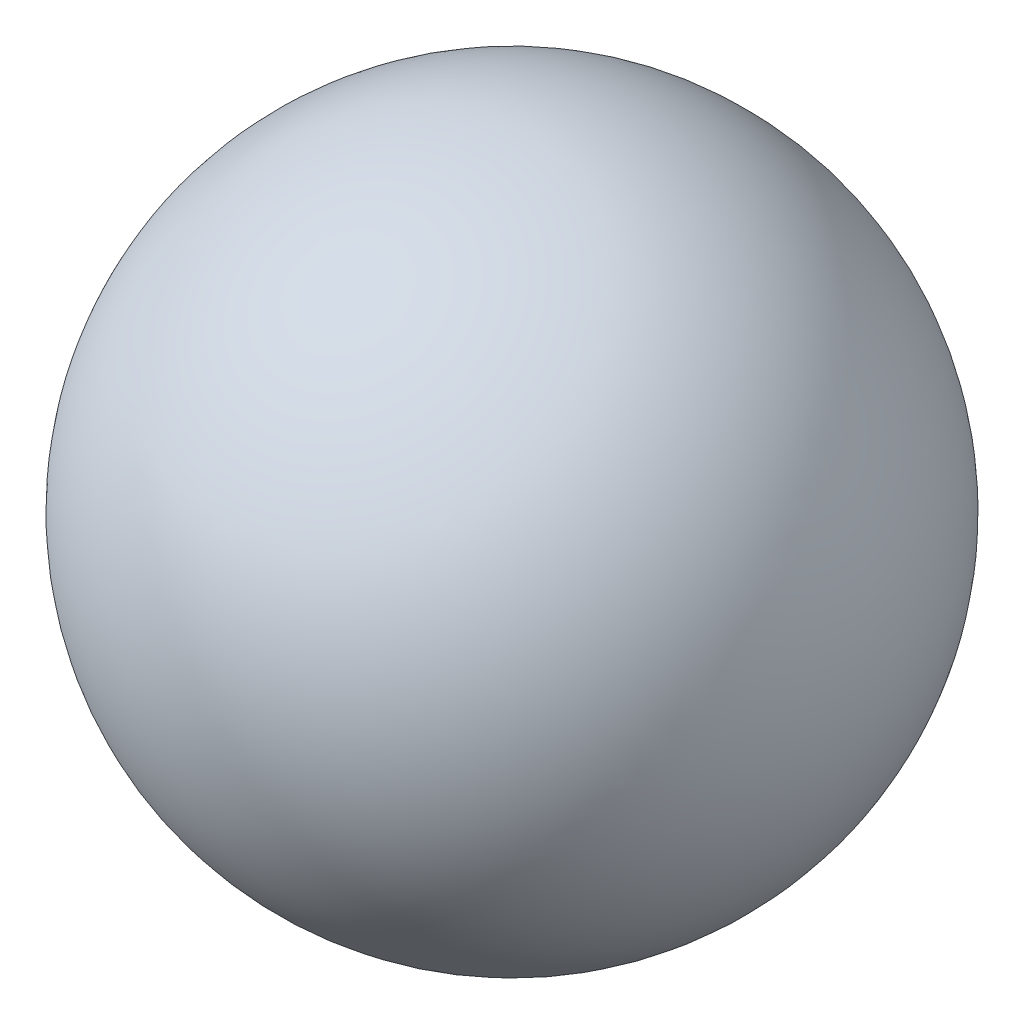
ISO-10303-21;
HEADER;
FILE_DESCRIPTION(('STEP AP214'),'2;1');
FILE_NAME('part.step','',(''),(''),'','','');
FILE_SCHEMA(('AUTOMOTIVE_DESIGN { 1 0 10303 214 1 1 1 1 }'));
ENDSEC;
DATA;
#1=APPLICATION_CONTEXT('core data for automotive mechanical design processes');
#2=APPLICATION_PROTOCOL_DEFINITION('international standard','automotive_design',2000,#1);
#3=PRODUCT_CONTEXT('',#1,'mechanical');
#4=PRODUCT('Part','Part','',(#3));
#5=PRODUCT_RELATED_PRODUCT_CATEGORY('part','',(#4));
#6=PRODUCT_DEFINITION_FORMATION('','',#4);
#7=PRODUCT_DEFINITION_CONTEXT('part definition',#1,'design');
#8=PRODUCT_DEFINITION('design','',#6,#7);
#9=PRODUCT_DEFINITION_SHAPE('','',#8);
#10=(LENGTH_UNIT() NAMED_UNIT(*) SI_UNIT(.MILLI.,.METRE.));
#11=(NAMED_UNIT(*) PLANE_ANGLE_UNIT() SI_UNIT($,.RADIAN.));
#12=(NAMED_UNIT(*) SI_UNIT($,.STERADIAN.) SOLID_ANGLE_UNIT());
#13=UNCERTAINTY_MEASURE_WITH_UNIT(LENGTH_MEASURE(1.E-05),#10,'distance_accuracy_value','');
#14=(GEOMETRIC_REPRESENTATION_CONTEXT(3) GLOBAL_UNCERTAINTY_ASSIGNED_CONTEXT((#13)) GLOBAL_UNIT_ASSIGNED_CONTEXT((#10,
#11,#12)) REPRESENTATION_CONTEXT('',''));
#15=CARTESIAN_POINT('',(0.,0.,0.));
#16=DIRECTION('',(0.,0.,1.));
#17=DIRECTION('',(1.,0.,0.));
#18=AXIS2_PLACEMENT_3D('',#15,#16,#17);
#19=CARTESIAN_POINT('',(-200.,0.,0.));
#20=DIRECTION('',(1.,0.,0.));
#21=DIRECTION('',(0.,0.,1.));
#22=AXIS2_PLACEMENT_3D('',#19,#20,#21);
#23=SPHERICAL_SURFACE('',#22,200.);
#24=CARTESIAN_POINT('',(0.,0.,0.));
#25=VERTEX_POINT('',#24);
#26=VERTEX_LOOP('',#25);
#27=FACE_BOUND('',#26,.T.);
#28=ADVANCED_FACE('F29',(#27),#23,.T.);
#29=CLOSED_SHELL('',(#28));
#30=MANIFOLD_SOLID_BREP('B2',#29);
#31=ADVANCED_BREP_SHAPE_REPRESENTATION('',(#18,#30),#14);
#32=SHAPE_DEFINITION_REPRESENTATION(#9,#31);
ENDSEC;
END-ISO-10303-21;
